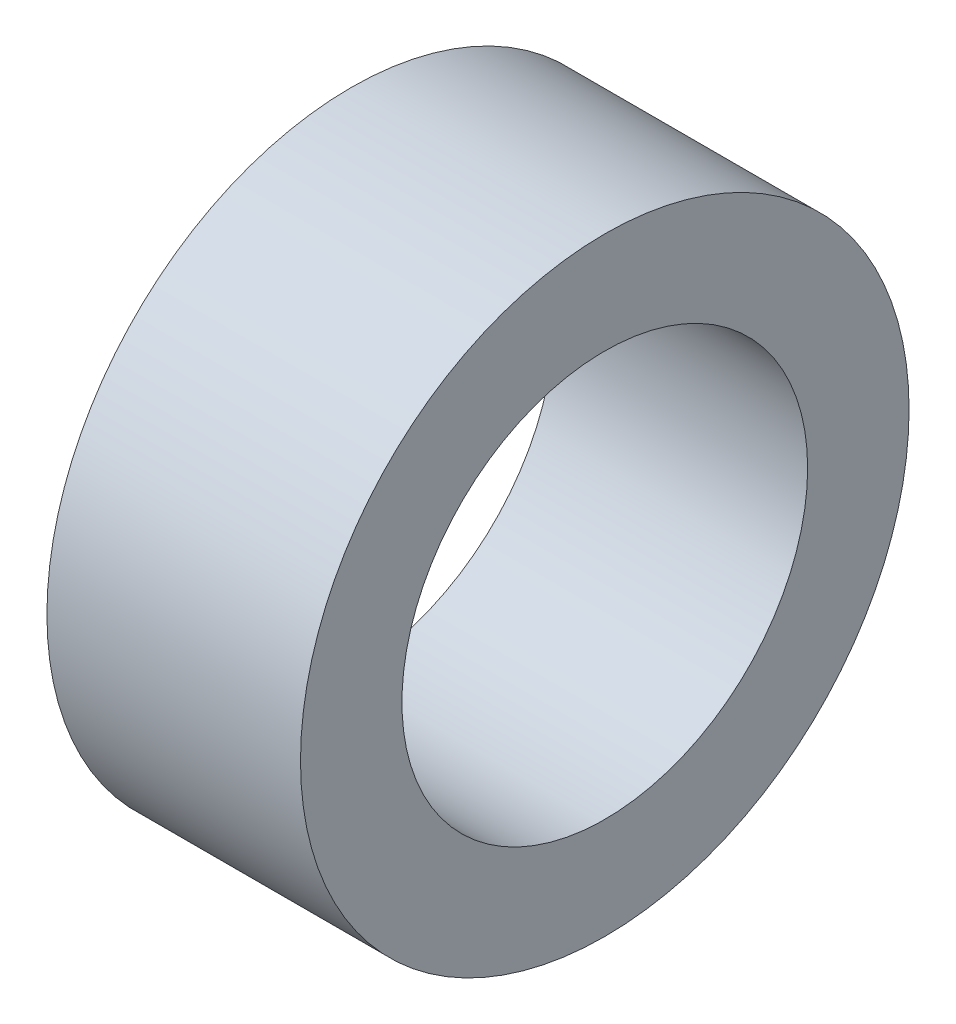
ISO-10303-21;
HEADER;
FILE_DESCRIPTION(('STEP AP214'),'2;1');
FILE_NAME('part.step','',(''),(''),'','','');
FILE_SCHEMA(('AUTOMOTIVE_DESIGN { 1 0 10303 214 1 1 1 1 }'));
ENDSEC;
DATA;
#1=APPLICATION_CONTEXT('core data for automotive mechanical design processes');
#2=APPLICATION_PROTOCOL_DEFINITION('international standard','automotive_design',2000,#1);
#3=PRODUCT_CONTEXT('',#1,'mechanical');
#4=PRODUCT('Part','Part','',(#3));
#5=PRODUCT_RELATED_PRODUCT_CATEGORY('part','',(#4));
#6=PRODUCT_DEFINITION_FORMATION('','',#4);
#7=PRODUCT_DEFINITION_CONTEXT('part definition',#1,'design');
#8=PRODUCT_DEFINITION('design','',#6,#7);
#9=PRODUCT_DEFINITION_SHAPE('','',#8);
#10=(LENGTH_UNIT() NAMED_UNIT(*) SI_UNIT(.MILLI.,.METRE.));
#11=(NAMED_UNIT(*) PLANE_ANGLE_UNIT() SI_UNIT($,.RADIAN.));
#12=(NAMED_UNIT(*) SI_UNIT($,.STERADIAN.) SOLID_ANGLE_UNIT());
#13=UNCERTAINTY_MEASURE_WITH_UNIT(LENGTH_MEASURE(1.E-05),#10,'distance_accuracy_value','');
#14=(GEOMETRIC_REPRESENTATION_CONTEXT(3) GLOBAL_UNCERTAINTY_ASSIGNED_CONTEXT((#13)) GLOBAL_UNIT_ASSIGNED_CONTEXT((#10,
#11,#12)) REPRESENTATION_CONTEXT('',''));
#15=CARTESIAN_POINT('',(0.,0.,0.));
#16=DIRECTION('',(0.,0.,1.));
#17=DIRECTION('',(1.,0.,0.));
#18=AXIS2_PLACEMENT_3D('',#15,#16,#17);
#19=CARTESIAN_POINT('',(6.35,0.,0.));
#20=DIRECTION('',(1.,0.,0.));
#21=DIRECTION('',(0.,0.,-1.));
#22=AXIS2_PLACEMENT_3D('',#19,#20,#21);
#23=PLANE('',#22);
#24=CARTESIAN_POINT('',(6.35,0.,0.));
#25=DIRECTION('',(1.,0.,0.));
#26=DIRECTION('',(0.,0.,-1.));
#27=AXIS2_PLACEMENT_3D('',#24,#25,#26);
#28=CIRCLE('',#27,7.62);
#29=CARTESIAN_POINT('',(6.35,0.,-7.62));
#30=VERTEX_POINT('',#29);
#31=EDGE_CURVE('E10',#30,#30,#28,.T.);
#32=ORIENTED_EDGE('',*,*,#31,.T.);
#33=EDGE_LOOP('',(#32));
#34=FACE_BOUND('',#33,.T.);
#35=CARTESIAN_POINT('',(6.35,0.,0.));
#36=DIRECTION('',(1.,0.,0.));
#37=DIRECTION('',(0.,0.,-1.));
#38=AXIS2_PLACEMENT_3D('',#35,#36,#37);
#39=CIRCLE('',#38,5.08);
#40=CARTESIAN_POINT('',(6.35,0.,-5.08));
#41=VERTEX_POINT('',#40);
#42=EDGE_CURVE('E43',#41,#41,#39,.T.);
#43=ORIENTED_EDGE('',*,*,#42,.F.);
#44=EDGE_LOOP('',(#43));
#45=FACE_BOUND('',#44,.T.);
#46=ADVANCED_FACE('F32',(#34,#45),#23,.T.);
#47=CARTESIAN_POINT('',(0.,0.,0.));
#48=DIRECTION('',(1.,0.,0.));
#49=DIRECTION('',(0.,0.,-1.));
#50=AXIS2_PLACEMENT_3D('',#47,#48,#49);
#51=PLANE('',#50);
#52=CARTESIAN_POINT('',(0.,0.,0.));
#53=DIRECTION('',(1.,0.,0.));
#54=DIRECTION('',(0.,0.,-1.));
#55=AXIS2_PLACEMENT_3D('',#52,#53,#54);
#56=CIRCLE('',#55,7.62);
#57=CARTESIAN_POINT('',(0.,0.,-7.62));
#58=VERTEX_POINT('',#57);
#59=EDGE_CURVE('E36',#58,#58,#56,.T.);
#60=ORIENTED_EDGE('',*,*,#59,.F.);
#61=EDGE_LOOP('',(#60));
#62=FACE_BOUND('',#61,.T.);
#63=CARTESIAN_POINT('',(0.,0.,0.));
#64=DIRECTION('',(1.,0.,0.));
#65=DIRECTION('',(0.,0.,-1.));
#66=AXIS2_PLACEMENT_3D('',#63,#64,#65);
#67=CIRCLE('',#66,5.08);
#68=CARTESIAN_POINT('',(0.,0.,-5.08));
#69=VERTEX_POINT('',#68);
#70=EDGE_CURVE('E45',#69,#69,#67,.T.);
#71=ORIENTED_EDGE('',*,*,#70,.T.);
#72=EDGE_LOOP('',(#71));
#73=FACE_BOUND('',#72,.T.);
#74=ADVANCED_FACE('F55',(#62,#73),#51,.F.);
#75=CARTESIAN_POINT('',(6.35,0.,0.));
#76=DIRECTION('',(-1.,0.,0.));
#77=DIRECTION('',(0.,0.,1.));
#78=AXIS2_PLACEMENT_3D('',#75,#76,#77);
#79=CYLINDRICAL_SURFACE('',#78,7.62);
#80=ORIENTED_EDGE('',*,*,#31,.F.);
#81=EDGE_LOOP('',(#80));
#82=FACE_BOUND('',#81,.T.);
#83=ORIENTED_EDGE('',*,*,#59,.T.);
#84=EDGE_LOOP('',(#83));
#85=FACE_BOUND('',#84,.T.);
#86=ADVANCED_FACE('F34',(#82,#85),#79,.T.);
#87=CARTESIAN_POINT('',(6.35,0.,0.));
#88=DIRECTION('',(-1.,0.,0.));
#89=DIRECTION('',(0.,0.,1.));
#90=AXIS2_PLACEMENT_3D('',#87,#88,#89);
#91=CYLINDRICAL_SURFACE('',#90,5.08);
#92=ORIENTED_EDGE('',*,*,#42,.T.);
#93=EDGE_LOOP('',(#92));
#94=FACE_BOUND('',#93,.T.);
#95=ORIENTED_EDGE('',*,*,#70,.F.);
#96=EDGE_LOOP('',(#95));
#97=FACE_BOUND('',#96,.T.);
#98=ADVANCED_FACE('F51',(#94,#97),#91,.F.);
#99=CLOSED_SHELL('',(#46,#74,#86,#98));
#100=MANIFOLD_SOLID_BREP('B2',#99);
#101=ADVANCED_BREP_SHAPE_REPRESENTATION('',(#18,#100),#14);
#102=SHAPE_DEFINITION_REPRESENTATION(#9,#101);
ENDSEC;
END-ISO-10303-21;
